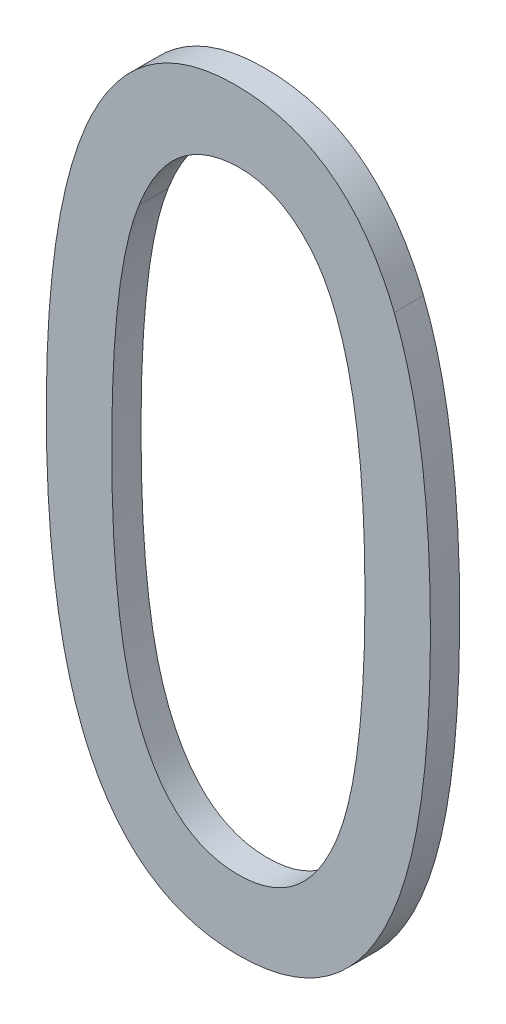
ISO-10303-21;
HEADER;
FILE_DESCRIPTION(('STEP AP214'),'2;1');
FILE_NAME('part.step','',(''),(''),'','','');
FILE_SCHEMA(('AUTOMOTIVE_DESIGN { 1 0 10303 214 1 1 1 1 }'));
ENDSEC;
DATA;
#1=APPLICATION_CONTEXT('core data for automotive mechanical design processes');
#2=APPLICATION_PROTOCOL_DEFINITION('international standard','automotive_design',2000,#1);
#3=PRODUCT_CONTEXT('',#1,'mechanical');
#4=PRODUCT('Part','Part','',(#3));
#5=PRODUCT_RELATED_PRODUCT_CATEGORY('part','',(#4));
#6=PRODUCT_DEFINITION_FORMATION('','',#4);
#7=PRODUCT_DEFINITION_CONTEXT('part definition',#1,'design');
#8=PRODUCT_DEFINITION('design','',#6,#7);
#9=PRODUCT_DEFINITION_SHAPE('','',#8);
#10=(LENGTH_UNIT() NAMED_UNIT(*) SI_UNIT(.MILLI.,.METRE.));
#11=(NAMED_UNIT(*) PLANE_ANGLE_UNIT() SI_UNIT($,.RADIAN.));
#12=(NAMED_UNIT(*) SI_UNIT($,.STERADIAN.) SOLID_ANGLE_UNIT());
#13=UNCERTAINTY_MEASURE_WITH_UNIT(LENGTH_MEASURE(1.E-05),#10,'distance_accuracy_value','');
#14=(GEOMETRIC_REPRESENTATION_CONTEXT(3) GLOBAL_UNCERTAINTY_ASSIGNED_CONTEXT((#13)) GLOBAL_UNIT_ASSIGNED_CONTEXT((#10,
#11,#12)) REPRESENTATION_CONTEXT('',''));
#15=CARTESIAN_POINT('',(0.,0.,0.));
#16=DIRECTION('',(0.,0.,1.));
#17=DIRECTION('',(1.,0.,0.));
#18=AXIS2_PLACEMENT_3D('',#15,#16,#17);
#19=CARTESIAN_POINT('',(162.713224235544,127.21231620352,-39.));
#20=DIRECTION('',(0.,0.,-1.));
#21=DIRECTION('',(-1.,0.,0.));
#22=AXIS2_PLACEMENT_3D('',#19,#20,#21);
#23=PLANE('',#22);
#24=CARTESIAN_POINT('',(162.81965721454,126.928948416499,-39.));
#25=CARTESIAN_POINT('',(162.8134844485,126.9132536326,-39.));
#26=CARTESIAN_POINT('',(162.807884951267,126.897351026162,-39.));
#27=CARTESIAN_POINT('',(162.797637601304,126.865261709913,-39.));
#28=CARTESIAN_POINT('',(162.792988567635,126.849075380124,-39.));
#29=CARTESIAN_POINT('',(162.780199813228,126.800398594227,-39.));
#30=CARTESIAN_POINT('',(162.773158052074,126.767623621181,-39.));
#31=CARTESIAN_POINT('',(162.761115496172,126.701804748235,-39.));
#32=CARTESIAN_POINT('',(162.756109814167,126.668761688815,-39.));
#33=CARTESIAN_POINT('',(162.747583944379,126.602483406797,-39.));
#34=CARTESIAN_POINT('',(162.744063992329,126.569248154551,-39.));
#35=CARTESIAN_POINT('',(162.738154306647,126.502527179504,-39.));
#36=CARTESIAN_POINT('',(162.735769840447,126.469041007509,-39.));
#37=CARTESIAN_POINT('',(162.731919552685,126.402020945451,-39.));
#38=CARTESIAN_POINT('',(162.730453639131,126.368487060503,-39.));
#39=CARTESIAN_POINT('',(162.727655261097,126.282333840904,-39.));
#40=CARTESIAN_POINT('',(162.726871964206,126.229697348207,-39.));
#41=CARTESIAN_POINT('',(162.726672446981,126.124407380514,-39.));
#42=CARTESIAN_POINT('',(162.727256647057,126.071753905273,-39.));
#43=CARTESIAN_POINT('',(162.730143616212,125.96667807193,-39.));
#44=CARTESIAN_POINT('',(162.732440205248,125.914255562964,-39.));
#45=CARTESIAN_POINT('',(162.739377497036,125.80958130951,-39.));
#46=CARTESIAN_POINT('',(162.744016825305,125.757329482953,-39.));
#47=CARTESIAN_POINT('',(162.754713800259,125.670096848505,-39.));
#48=CARTESIAN_POINT('',(162.759824790193,125.635005806208,-39.));
#49=CARTESIAN_POINT('',(162.769198628372,125.582601834786,-39.));
#50=CARTESIAN_POINT('',(162.77261623298,125.565138416614,-39.));
#51=CARTESIAN_POINT('',(162.780151679044,125.530363641215,-39.));
#52=CARTESIAN_POINT('',(162.784269391651,125.513052256624,-39.));
#53=CARTESIAN_POINT('',(162.791651093667,125.485179486085,-39.));
#54=CARTESIAN_POINT('',(162.79464683408,125.47454742445,-39.));
#55=CARTESIAN_POINT('',(162.80103873177,125.453407013795,-39.));
#56=CARTESIAN_POINT('',(162.804434823213,125.442898644748,-39.));
#57=CARTESIAN_POINT('',(162.815155948368,125.411529648948,-39.));
#58=CARTESIAN_POINT('',(162.823008671458,125.390844351044,-39.));
#59=CARTESIAN_POINT('',(162.840434063982,125.350333566177,-39.));
#60=CARTESIAN_POINT('',(162.849997025759,125.33050397234,-39.));
#61=CARTESIAN_POINT('',(162.871260901099,125.29203206789,-39.));
#62=CARTESIAN_POINT('',(162.882958563842,125.273388009325,-39.));
#63=CARTESIAN_POINT('',(162.906839859012,125.240815954733,-39.));
#64=CARTESIAN_POINT('',(162.918641490116,125.226612110535,-39.));
#65=CARTESIAN_POINT('',(162.944228175459,125.200122518193,-39.));
#66=CARTESIAN_POINT('',(162.958010068016,125.187833776389,-39.));
#67=CARTESIAN_POINT('',(162.9876868168,125.165732391389,-39.));
#68=CARTESIAN_POINT('',(163.00360208045,125.155946714029,-39.));
#69=CARTESIAN_POINT('',(163.037017065211,125.139609832536,-39.));
#70=CARTESIAN_POINT('',(163.054516280028,125.133057599154,-39.));
#71=CARTESIAN_POINT('',(163.088512442128,125.123852414056,-39.));
#72=CARTESIAN_POINT('',(163.104920453074,125.120861105097,-39.));
#73=CARTESIAN_POINT('',(163.138019863858,125.117318580688,-39.));
#74=CARTESIAN_POINT('',(163.154711878667,125.116773594918,-39.));
#75=CARTESIAN_POINT('',(163.190247567182,125.118003531979,-39.));
#76=CARTESIAN_POINT('',(163.209082585592,125.120096169283,-39.));
#77=CARTESIAN_POINT('',(163.246017764625,125.127690302763,-39.));
#78=CARTESIAN_POINT('',(163.264120230255,125.133180047794,-39.));
#79=CARTESIAN_POINT('',(163.297961020812,125.147167435493,-39.));
#80=CARTESIAN_POINT('',(163.313774539637,125.155483745994,-39.));
#81=CARTESIAN_POINT('',(163.343702967706,125.174769768659,-39.));
#82=CARTESIAN_POINT('',(163.357815251652,125.185743505126,-39.));
#83=CARTESIAN_POINT('',(163.388090196325,125.213297000385,-39.));
#84=CARTESIAN_POINT('',(163.403611778472,125.230573008783,-39.));
#85=CARTESIAN_POINT('',(163.431801384555,125.267355855728,-39.));
#86=CARTESIAN_POINT('',(163.444457387533,125.286871592626,-39.));
#87=CARTESIAN_POINT('',(163.464327878853,125.321875723023,-39.));
#88=CARTESIAN_POINT('',(163.472095444489,125.337060091012,-39.));
#89=CARTESIAN_POINT('',(163.486450264703,125.367792273056,-39.));
#90=CARTESIAN_POINT('',(163.493048707158,125.383334828578,-39.));
#91=CARTESIAN_POINT('',(163.499197792604,125.399038411206,-39.));
#92=B_SPLINE_CURVE_WITH_KNOTS('',3,(#24,#25,#26,#27,#28,#29,#30,#31,#32,#33,#34,#35,#36,#37,#38,
#39,#40,#41,#42,#43,#44,#45,#46,#47,#48,#49,#50,#51,#52,#53,#54,#55,#56,#57,#58,#59,#60,#61,#62,
#63,#64,#65,#66,#67,#68,#69,#70,#71,#72,#73,#74,#75,#76,#77,#78,#79,#80,#81,#82,#83,#84,#85,#86,
#87,#88,#89,#90,#91),.UNSPECIFIED.,.F.,.F.,(4,2,2,2,2,2,2,2,2,2,2,2,2,2,2,2,2,2,2,2,2,2,2,2,2,2,
2,2,2,2,2,2,2,4),(0.,0.0505598864734928,0.101056565921449,0.201520398804551,0.30174164193107,
0.401978780703057,0.502676488224877,0.603364109413484,0.761266343733168,0.919217128384105,
1.07660060838369,1.23389185876919,1.34021706621775,1.39359050964282,1.44695414085766,
1.48008500979698,1.51321043823765,1.57952088188141,1.64546623600253,1.71131199109488,
1.76654814266498,1.82169706452467,1.87741721830735,1.93311962417807,1.98294739535678,
2.03290198362764,2.08949093296318,2.14588521783798,2.19918888570076,2.25257378499866,
2.32185784254094,2.39142736965928,2.44255239605389,2.49315810580367),.UNSPECIFIED.);
#93=CARTESIAN_POINT('',(162.81965721454,126.928948416499,-39.));
#94=VERTEX_POINT('',#93);
#95=CARTESIAN_POINT('',(163.499197792604,125.399038411206,-39.));
#96=VERTEX_POINT('',#95);
#97=EDGE_CURVE('E82',#94,#96,#92,.T.);
#98=ORIENTED_EDGE('',*,*,#97,.F.);
#99=CARTESIAN_POINT('',(163.499197792604,125.399038411206,-39.));
#100=CARTESIAN_POINT('',(163.505322427112,125.414739762002,-39.));
#101=CARTESIAN_POINT('',(163.510885514498,125.430643427273,-39.));
#102=CARTESIAN_POINT('',(163.5210769636,125.462728729021,-39.));
#103=CARTESIAN_POINT('',(163.525706435265,125.478910010305,-39.));
#104=CARTESIAN_POINT('',(163.538457321666,125.527590671538,-39.));
#105=CARTESIAN_POINT('',(163.545493006535,125.560370708689,-39.));
#106=CARTESIAN_POINT('',(163.557539658802,125.626206099966,-39.));
#107=CARTESIAN_POINT('',(163.562554976667,125.659260704397,-39.));
#108=CARTESIAN_POINT('',(163.571100953329,125.725561759351,-39.));
#109=CARTESIAN_POINT('',(163.574631369045,125.758808240382,-39.));
#110=CARTESIAN_POINT('',(163.583551309013,125.858936864082,-39.));
#111=CARTESIAN_POINT('',(163.587231808044,125.925969366923,-39.));
#112=CARTESIAN_POINT('',(163.590521172219,126.026437311402,-39.));
#113=CARTESIAN_POINT('',(163.59124644928,126.059850293964,-39.));
#114=CARTESIAN_POINT('',(163.592086362,126.126685847795,-39.));
#115=CARTESIAN_POINT('',(163.592200972737,126.1601084194,-39.));
#116=CARTESIAN_POINT('',(163.591622930262,126.260161050749,-39.));
#117=CARTESIAN_POINT('',(163.59001511949,126.326792772413,-39.));
#118=CARTESIAN_POINT('',(163.583918866786,126.447777795609,-39.));
#119=CARTESIAN_POINT('',(163.580007776156,126.502159284629,-39.));
#120=CARTESIAN_POINT('',(163.568938196671,126.610987434158,-39.));
#121=CARTESIAN_POINT('',(163.561758791348,126.665432225956,-39.));
#122=CARTESIAN_POINT('',(163.547227840337,126.746880825657,-39.));
#123=CARTESIAN_POINT('',(163.541698867997,126.774206456517,-39.));
#124=CARTESIAN_POINT('',(163.529003164453,126.828468998898,-39.));
#125=CARTESIAN_POINT('',(163.521837467319,126.855406144487,-39.));
#126=CARTESIAN_POINT('',(163.505434884125,126.908348600257,-39.));
#127=CARTESIAN_POINT('',(163.496220113197,126.93436065426,-39.));
#128=CARTESIAN_POINT('',(163.47493047355,126.985178523736,-39.));
#129=CARTESIAN_POINT('',(163.462863954348,127.009987610473,-39.));
#130=CARTESIAN_POINT('',(163.443868547071,127.041954304919,-39.));
#131=CARTESIAN_POINT('',(163.438669579844,127.050143229378,-39.));
#132=CARTESIAN_POINT('',(163.427724917998,127.066148485094,-39.));
#133=CARTESIAN_POINT('',(163.421979420998,127.073964949506,-39.));
#134=CARTESIAN_POINT('',(163.409850947436,127.089113301841,-39.));
#135=CARTESIAN_POINT('',(163.403466589391,127.096444080067,-39.));
#136=CARTESIAN_POINT('',(163.390241502005,127.110686147085,-39.));
#137=CARTESIAN_POINT('',(163.383400512422,127.117597192304,-39.));
#138=CARTESIAN_POINT('',(163.369181736336,127.130944059741,-39.));
#139=CARTESIAN_POINT('',(163.36180080604,127.137376571876,-39.));
#140=CARTESIAN_POINT('',(163.346546819658,127.149617759199,-39.));
#141=CARTESIAN_POINT('',(163.338673984628,127.155426711465,-39.));
#142=CARTESIAN_POINT('',(163.314364521425,127.171731729472,-39.));
#143=CARTESIAN_POINT('',(163.297180650172,127.181160385396,-39.));
#144=CARTESIAN_POINT('',(163.261916496351,127.196074883058,-39.));
#145=CARTESIAN_POINT('',(163.24389364307,127.201694800711,-39.));
#146=CARTESIAN_POINT('',(163.216299540372,127.207389916442,-39.));
#147=CARTESIAN_POINT('',(163.206990950461,127.208832612515,-39.));
#148=CARTESIAN_POINT('',(163.188273706997,127.210811705159,-39.));
#149=CARTESIAN_POINT('',(163.178865026605,127.21134785214,-39.));
#150=CARTESIAN_POINT('',(163.161323642574,127.21159469605,-39.));
#151=CARTESIAN_POINT('',(163.153191650627,127.211407854803,-39.));
#152=CARTESIAN_POINT('',(163.136957862843,127.210525157236,-39.));
#153=CARTESIAN_POINT('',(163.128856062477,127.209829380619,-39.));
#154=CARTESIAN_POINT('',(163.104669426145,127.206877594109,-39.));
#155=CARTESIAN_POINT('',(163.088678298672,127.203757649748,-39.));
#156=CARTESIAN_POINT('',(163.054309356366,127.19418365331,-39.));
#157=CARTESIAN_POINT('',(163.036075879066,127.187197164989,-39.));
#158=CARTESIAN_POINT('',(163.001338396239,127.169825519232,-39.));
#159=CARTESIAN_POINT('',(162.98483274229,127.159443640891,-39.));
#160=CARTESIAN_POINT('',(162.95271903835,127.134952458311,-39.));
#161=CARTESIAN_POINT('',(162.937291602276,127.120609569158,-39.));
#162=CARTESIAN_POINT('',(162.908898430826,127.089554214469,-39.));
#163=CARTESIAN_POINT('',(162.895948440214,127.07282770049,-39.));
#164=CARTESIAN_POINT('',(162.870751441382,127.035557881647,-39.));
#165=CARTESIAN_POINT('',(162.858826371374,127.01480272305,-39.));
#166=CARTESIAN_POINT('',(162.837542377177,126.97241978189,-39.));
#167=CARTESIAN_POINT('',(162.828145183741,126.950811460588,-39.));
#168=CARTESIAN_POINT('',(162.81965721454,126.928948416499,-39.));
#169=B_SPLINE_CURVE_WITH_KNOTS('',3,(#99,#100,#101,#102,#103,#104,#105,#106,#107,#108,#109,#110,
#111,#112,#113,#114,#115,#116,#117,#118,#119,#120,#121,#122,#123,#124,#125,#126,#127,#128,#129,
#130,#131,#132,#133,#134,#135,#136,#137,#138,#139,#140,#141,#142,#143,#144,#145,#146,#147,#148,
#149,#150,#151,#152,#153,#154,#155,#156,#157,#158,#159,#160,#161,#162,#163,#164,#165,#166,#167,
#168),.UNSPECIFIED.,.F.,.F.,(4,2,2,2,2,2,2,2,2,2,2,2,2,2,2,2,2,2,2,2,2,2,2,2,2,2,2,2,2,2,2,2,2,
2,4),(0.,0.0505272345243584,0.100994039860473,0.201471045431679,0.301730521681772,
0.402006404171568,0.60328173282029,0.703542383201974,0.803807125552918,1.0036863608285,
1.16719799616357,1.33177110790104,1.41537414136467,1.49892450044971,1.58161347457552,
1.66406328249418,1.69314592018893,1.72221808157996,1.75135452644088,1.78050772084123,
1.80984674962599,1.83917268730333,1.89759272369427,1.95383140320012,1.98205245785215,
2.01028128100678,2.03466611588514,2.05904713274505,2.10773462855995,2.16593738065235,
2.22408408863903,2.28693439901847,2.35017175556561,2.42181005807198,2.49229349340743),.UNSPECIFIED.);
#170=EDGE_CURVE('E80',#96,#94,#169,.T.);
#171=ORIENTED_EDGE('',*,*,#170,.F.);
#172=EDGE_LOOP('',(#98,#171));
#173=FACE_BOUND('',#172,.T.);
#174=CARTESIAN_POINT('',(163.692054033926,127.047397331269,-39.));
#175=CARTESIAN_POINT('',(163.704516349728,127.016239052959,-39.));
#176=CARTESIAN_POINT('',(163.71551386743,126.984553230297,-39.));
#177=CARTESIAN_POINT('',(163.735066490346,126.920532400283,-39.));
#178=CARTESIAN_POINT('',(163.743628773889,126.888199608038,-39.));
#179=CARTESIAN_POINT('',(163.766500566805,126.790485439633,-39.));
#180=CARTESIAN_POINT('',(163.777971610316,126.724453357786,-39.));
#181=CARTESIAN_POINT('',(163.795807013261,126.591590758617,-39.));
#182=CARTESIAN_POINT('',(163.802157161003,126.524758538116,-39.));
#183=CARTESIAN_POINT('',(163.811109644074,126.391124081756,-39.));
#184=CARTESIAN_POINT('',(163.813726887734,126.324322797828,-39.));
#185=CARTESIAN_POINT('',(163.815539011626,126.224164073656,-39.));
#186=CARTESIAN_POINT('',(163.815791568004,126.190818575861,-39.));
#187=CARTESIAN_POINT('',(163.815682273306,126.124128247136,-39.));
#188=CARTESIAN_POINT('',(163.815320423262,126.090783416205,-39.));
#189=CARTESIAN_POINT('',(163.813197933937,125.990835520696,-39.));
#190=CARTESIAN_POINT('',(163.810401755168,125.924249957834,-39.));
#191=CARTESIAN_POINT('',(163.801092778465,125.790979948071,-39.));
#192=CARTESIAN_POINT('',(163.794561894739,125.724296606594,-39.));
#193=CARTESIAN_POINT('',(163.779337057708,125.614477984008,-39.));
#194=CARTESIAN_POINT('',(163.772160938042,125.571136226896,-39.));
#195=CARTESIAN_POINT('',(163.75480490558,125.484991781117,-39.));
#196=CARTESIAN_POINT('',(163.744622479836,125.442189574791,-39.));
#197=CARTESIAN_POINT('',(163.720260212584,125.358090061591,-39.));
#198=CARTESIAN_POINT('',(163.706113652657,125.316783327719,-39.));
#199=CARTESIAN_POINT('',(163.673037379582,125.236169628208,-39.));
#200=CARTESIAN_POINT('',(163.65412000488,125.196857813552,-39.));
#201=CARTESIAN_POINT('',(163.616486643065,125.132691357331,-39.));
#202=CARTESIAN_POINT('',(163.599303946285,125.10695083373,-39.));
#203=CARTESIAN_POINT('',(163.561386562326,125.058191271206,-39.));
#204=CARTESIAN_POINT('',(163.540653509967,125.035170987913,-39.));
#205=CARTESIAN_POINT('',(163.495227903633,124.992782631732,-39.));
#206=CARTESIAN_POINT('',(163.470492586655,124.973459568495,-39.));
#207=CARTESIAN_POINT('',(163.417757330673,124.94000460659,-39.));
#208=CARTESIAN_POINT('',(163.38976264747,124.925864498956,-39.));
#209=CARTESIAN_POINT('',(163.334938842379,124.904553866301,-39.));
#210=CARTESIAN_POINT('',(163.308342982861,124.896770916636,-39.));
#211=CARTESIAN_POINT('',(163.254209244307,124.885416501214,-39.));
#212=CARTESIAN_POINT('',(163.226668944096,124.881856845887,-39.));
#213=CARTESIAN_POINT('',(163.184039623071,124.879213715785,-39.));
#214=CARTESIAN_POINT('',(163.169011980785,124.878828071462,-39.));
#215=CARTESIAN_POINT('',(163.138964089566,124.879051701823,-39.));
#216=CARTESIAN_POINT('',(163.12394384101,124.879661022907,-39.));
#217=CARTESIAN_POINT('',(163.079049231334,124.88315286892,-39.));
#218=CARTESIAN_POINT('',(163.049272992495,124.887694520213,-39.));
#219=CARTESIAN_POINT('',(162.993343770729,124.901266698453,-39.));
#220=CARTESIAN_POINT('',(162.967094613356,124.909895658549,-39.));
#221=CARTESIAN_POINT('',(162.916504450116,124.931519950501,-39.));
#222=CARTESIAN_POINT('',(162.892159853067,124.944506807961,-39.));
#223=CARTESIAN_POINT('',(162.846129249909,124.974383658127,-39.));
#224=CARTESIAN_POINT('',(162.824434820934,124.991260765327,-39.));
#225=CARTESIAN_POINT('',(162.783845320252,125.028261644663,-39.));
#226=CARTESIAN_POINT('',(162.764965618006,125.04840207252,-39.));
#227=CARTESIAN_POINT('',(162.721548753456,125.101439244545,-39.));
#228=CARTESIAN_POINT('',(162.698774037328,125.135750005299,-39.));
#229=CARTESIAN_POINT('',(162.658924288357,125.206979693701,-39.));
#230=CARTESIAN_POINT('',(162.641776933344,125.243857486225,-39.));
#231=CARTESIAN_POINT('',(162.626800973217,125.281251222217,-39.));
#232=B_SPLINE_CURVE_WITH_KNOTS('',3,(#174,#175,#176,#177,#178,#179,#180,#181,#182,#183,#184,
#185,#186,#187,#188,#189,#190,#191,#192,#193,#194,#195,#196,#197,#198,#199,#200,#201,#202,#203,
#204,#205,#206,#207,#208,#209,#210,#211,#212,#213,#214,#215,#216,#217,#218,#219,#220,#221,#222,
#223,#224,#225,#226,#227,#228,#229,#230,#231),.UNSPECIFIED.,.F.,.F.,(4,2,2,2,2,2,2,2,2,2,2,2,2,
2,2,2,2,2,2,2,2,2,2,2,2,2,2,2,4),(0.,0.100558694918868,0.200817826406479,0.401542047706388,
0.602821427213916,0.803294672023267,0.903330108470041,1.00336537691816,1.20322873447941,
1.40406825296392,1.53579185395414,1.66762587495601,1.79838461587437,1.92880859115141,
2.02140063548079,2.11395015836423,2.20756322165538,2.30102736961859,2.3837951870279,
2.46679392288349,2.5118632213648,2.55693462169352,2.64687466350649,2.72938910637855,
2.81174401210934,2.89382996037286,2.97634889005706,3.09931227669091,3.22062708793923),.UNSPECIFIED.);
#233=CARTESIAN_POINT('',(163.692054033926,127.047397331269,-39.));
#234=VERTEX_POINT('',#233);
#235=CARTESIAN_POINT('',(162.626800973217,125.281251222217,-39.));
#236=VERTEX_POINT('',#235);
#237=EDGE_CURVE('E67',#234,#236,#232,.T.);
#238=ORIENTED_EDGE('',*,*,#237,.F.);
#239=CARTESIAN_POINT('',(162.626800973217,125.281251222217,-39.));
#240=CARTESIAN_POINT('',(162.614372421751,125.312438437969,-39.));
#241=CARTESIAN_POINT('',(162.603397346855,125.344151570257,-39.));
#242=CARTESIAN_POINT('',(162.583891946106,125.408186833191,-39.));
#243=CARTESIAN_POINT('',(162.575351823913,125.440505949572,-39.));
#244=CARTESIAN_POINT('',(162.560152557446,125.505605658729,-39.));
#245=CARTESIAN_POINT('',(162.553495482818,125.538386718016,-39.));
#246=CARTESIAN_POINT('',(162.541735335393,125.604230220191,-39.));
#247=CARTESIAN_POINT('',(162.536632584214,125.637292719861,-39.));
#248=CARTESIAN_POINT('',(162.527700646534,125.703715925087,-39.));
#249=CARTESIAN_POINT('',(162.523876456175,125.737077289236,-39.));
#250=CARTESIAN_POINT('',(162.517327287594,125.803902241854,-39.));
#251=CARTESIAN_POINT('',(162.514602212573,125.837365821059,-39.));
#252=CARTESIAN_POINT('',(162.507906952346,125.936709324496,-39.));
#253=CARTESIAN_POINT('',(162.505276379631,126.002680957742,-39.));
#254=CARTESIAN_POINT('',(162.503378707812,126.101675553336,-39.));
#255=CARTESIAN_POINT('',(162.503087687739,126.134687712191,-39.));
#256=CARTESIAN_POINT('',(162.503135038236,126.200719925422,-39.));
#257=CARTESIAN_POINT('',(162.503473553174,126.233739979873,-39.));
#258=CARTESIAN_POINT('',(162.505568025031,126.332578651519,-39.));
#259=CARTESIAN_POINT('',(162.508398322543,126.398379850558,-39.));
#260=CARTESIAN_POINT('',(162.51776415504,126.529710864489,-39.));
#261=CARTESIAN_POINT('',(162.524297933443,126.595240793214,-39.));
#262=CARTESIAN_POINT('',(162.540539432054,126.712240766798,-39.));
#263=CARTESIAN_POINT('',(162.549320241303,126.763835532175,-39.));
#264=CARTESIAN_POINT('',(162.571110274626,126.866292871823,-39.));
#265=CARTESIAN_POINT('',(162.584129298853,126.917153461004,-39.));
#266=CARTESIAN_POINT('',(162.61609221524,127.017784134273,-39.));
#267=CARTESIAN_POINT('',(162.635112416527,127.067530800492,-39.));
#268=CARTESIAN_POINT('',(162.681310712821,127.163108181109,-39.));
#269=CARTESIAN_POINT('',(162.708446670672,127.208957588125,-39.));
#270=CARTESIAN_POINT('',(162.758172998801,127.273097291111,-39.));
#271=CARTESIAN_POINT('',(162.776997579081,127.29428001906,-39.));
#272=CARTESIAN_POINT('',(162.817784095223,127.333358878961,-39.));
#273=CARTESIAN_POINT('',(162.839740387353,127.351260793533,-39.));
#274=CARTESIAN_POINT('',(162.886666753729,127.382968304412,-39.));
#275=CARTESIAN_POINT('',(162.911655613508,127.396746322067,-39.));
#276=CARTESIAN_POINT('',(162.963768172004,127.419488708747,-39.));
#277=CARTESIAN_POINT('',(162.990894141087,127.42844787719,-39.));
#278=CARTESIAN_POINT('',(163.034453299276,127.438826092904,-39.));
#279=CARTESIAN_POINT('',(163.050534429617,127.441831460384,-39.));
#280=CARTESIAN_POINT('',(163.082909432708,127.446389016085,-39.));
#281=CARTESIAN_POINT('',(163.099203384562,127.447940647427,-39.));
#282=CARTESIAN_POINT('',(163.131903672785,127.449709274447,-39.));
#283=CARTESIAN_POINT('',(163.148310197375,127.449922434881,-39.));
#284=CARTESIAN_POINT('',(163.181096956771,127.449196107889,-39.));
#285=CARTESIAN_POINT('',(163.197477191341,127.448256610121,-39.));
#286=CARTESIAN_POINT('',(163.230491328927,127.445045138324,-39.));
#287=CARTESIAN_POINT('',(163.247122475831,127.442743207883,-39.));
#288=CARTESIAN_POINT('',(163.280108265208,127.436680429768,-39.));
#289=CARTESIAN_POINT('',(163.29646297323,127.43291993317,-39.));
#290=CARTESIAN_POINT('',(163.344725375998,127.419338018988,-39.));
#291=CARTESIAN_POINT('',(163.376031208704,127.407199497073,-39.));
#292=CARTESIAN_POINT('',(163.432538777686,127.37827772482,-39.));
#293=CARTESIAN_POINT('',(163.458038031974,127.362069578845,-39.));
#294=CARTESIAN_POINT('',(163.505801920238,127.325361282833,-39.));
#295=CARTESIAN_POINT('',(163.528058236648,127.304850414373,-39.));
#296=CARTESIAN_POINT('',(163.574736758744,127.254507298031,-39.));
#297=CARTESIAN_POINT('',(163.598057156322,127.223665617727,-39.));
#298=CARTESIAN_POINT('',(163.639559918572,127.158771336518,-39.));
#299=CARTESIAN_POINT('',(163.657737466629,127.124715765134,-39.));
#300=CARTESIAN_POINT('',(163.680211621763,127.075747667786,-39.));
#301=CARTESIAN_POINT('',(163.686286485387,127.061626812379,-39.));
#302=CARTESIAN_POINT('',(163.692054033926,127.047397331269,-39.));
#303=B_SPLINE_CURVE_WITH_KNOTS('',3,(#239,#240,#241,#242,#243,#244,#245,#246,#247,#248,#249,
#250,#251,#252,#253,#254,#255,#256,#257,#258,#259,#260,#261,#262,#263,#264,#265,#266,#267,#268,
#269,#270,#271,#272,#273,#274,#275,#276,#277,#278,#279,#280,#281,#282,#283,#284,#285,#286,#287,
#288,#289,#290,#291,#292,#293,#294,#295,#296,#297,#298,#299,#300,#301,#302),.UNSPECIFIED.,.F.,
.F.,(4,2,2,2,2,2,2,2,2,2,2,2,2,2,2,2,2,2,2,2,2,2,2,2,2,2,2,2,2,2,2,4),(0.,0.100610747931688,
0.200810813564842,0.30112058438777,0.401451097140875,0.50216920297916,0.602878436567561,
0.800859480675481,0.899896603984995,0.998956441695701,1.19646422326872,1.39387840405627,
1.55076633803255,1.70801965667093,1.86735912610077,2.02588525484784,2.11060474335928,
2.19517344188428,2.28029566957847,2.3655095791808,2.41452921553174,2.46356762208212,
2.51274647897314,2.56192577708358,2.61222881688859,2.66251975628213,2.76250912971167,
2.85265199939589,2.94302214686374,3.05837189556448,3.17382932187213,3.2199194418832),.UNSPECIFIED.);
#304=EDGE_CURVE('E24',#236,#234,#303,.T.);
#305=ORIENTED_EDGE('',*,*,#304,.F.);
#306=EDGE_LOOP('',(#238,#305));
#307=FACE_BOUND('',#306,.T.);
#308=ADVANCED_FACE('F17',(#173,#307),#23,.F.);
#309=CARTESIAN_POINT('',(163.692054033926,127.047397331269,-39.1));
#310=CARTESIAN_POINT('',(163.692054033926,127.047397331269,-39.));
#311=CARTESIAN_POINT('',(163.583509290773,127.315396272508,-39.1));
#312=CARTESIAN_POINT('',(163.583509290773,127.315396272508,-39.));
#313=CARTESIAN_POINT('',(163.402264812672,127.449726606018,-39.1));
#314=CARTESIAN_POINT('',(163.402264812672,127.449726606018,-39.));
#315=CARTESIAN_POINT('',(162.718685360444,127.449726606018,-39.1));
#316=CARTESIAN_POINT('',(162.718685360444,127.449726606018,-39.));
#317=CARTESIAN_POINT('',(162.50311045195,127.021590025817,-39.1));
#318=CARTESIAN_POINT('',(162.50311045195,127.021590025817,-39.));
#319=CARTESIAN_POINT('',(162.50311045195,125.781515912529,-39.1));
#320=CARTESIAN_POINT('',(162.50311045195,125.781515912529,-39.));
#321=CARTESIAN_POINT('',(162.544508912129,125.487047940057,-39.1));
#322=CARTESIAN_POINT('',(162.544508912129,125.487047940057,-39.));
#323=CARTESIAN_POINT('',(162.626800973217,125.281251222217,-39.1));
#324=CARTESIAN_POINT('',(162.626800973217,125.281251222217,-39.));
#325=B_SPLINE_SURFACE_WITH_KNOTS('',3,1,((#309,#310),(#311,#312),(#313,#314),(#315,#316),(#317,
#318),(#319,#320),(#321,#322),(#323,#324)),.UNSPECIFIED.,.F.,.F.,.F.,(4,2,2,4),(2,2),(0.,
0.288697589169657,0.780232606258928,1.),(1.,1.1),.UNSPECIFIED.);
#326=CARTESIAN_POINT('',(162.626800973217,125.281251222217,-39.1));
#327=CARTESIAN_POINT('',(162.614372421751,125.312438437969,-39.1));
#328=CARTESIAN_POINT('',(162.603397346855,125.344151570257,-39.1));
#329=CARTESIAN_POINT('',(162.583891946106,125.408186833191,-39.1));
#330=CARTESIAN_POINT('',(162.575351823913,125.440505949572,-39.1));
#331=CARTESIAN_POINT('',(162.560152557446,125.505605658729,-39.1));
#332=CARTESIAN_POINT('',(162.553495482818,125.538386718016,-39.1));
#333=CARTESIAN_POINT('',(162.541735335393,125.604230220191,-39.1));
#334=CARTESIAN_POINT('',(162.536632584214,125.637292719861,-39.1));
#335=CARTESIAN_POINT('',(162.527700646534,125.703715925087,-39.1));
#336=CARTESIAN_POINT('',(162.523876456175,125.737077289236,-39.1));
#337=CARTESIAN_POINT('',(162.517327287594,125.803902241854,-39.1));
#338=CARTESIAN_POINT('',(162.514602212573,125.837365821059,-39.1));
#339=CARTESIAN_POINT('',(162.507906952346,125.936709324496,-39.1));
#340=CARTESIAN_POINT('',(162.505276379631,126.002680957742,-39.1));
#341=CARTESIAN_POINT('',(162.503378707812,126.101675553336,-39.1));
#342=CARTESIAN_POINT('',(162.503087687739,126.134687712191,-39.1));
#343=CARTESIAN_POINT('',(162.503135038236,126.200719925422,-39.1));
#344=CARTESIAN_POINT('',(162.503473553174,126.233739979873,-39.1));
#345=CARTESIAN_POINT('',(162.505568025031,126.332578651519,-39.1));
#346=CARTESIAN_POINT('',(162.508398322543,126.398379850558,-39.1));
#347=CARTESIAN_POINT('',(162.51776415504,126.529710864489,-39.1));
#348=CARTESIAN_POINT('',(162.524297933443,126.595240793214,-39.1));
#349=CARTESIAN_POINT('',(162.540539432054,126.712240766798,-39.1));
#350=CARTESIAN_POINT('',(162.549320241303,126.763835532175,-39.1));
#351=CARTESIAN_POINT('',(162.571110274626,126.866292871823,-39.1));
#352=CARTESIAN_POINT('',(162.584129298853,126.917153461004,-39.1));
#353=CARTESIAN_POINT('',(162.61609221524,127.017784134273,-39.1));
#354=CARTESIAN_POINT('',(162.635112416527,127.067530800492,-39.1));
#355=CARTESIAN_POINT('',(162.681310712821,127.163108181109,-39.1));
#356=CARTESIAN_POINT('',(162.708446670672,127.208957588125,-39.1));
#357=CARTESIAN_POINT('',(162.758172998801,127.273097291111,-39.1));
#358=CARTESIAN_POINT('',(162.776997579081,127.29428001906,-39.1));
#359=CARTESIAN_POINT('',(162.817784095223,127.333358878961,-39.1));
#360=CARTESIAN_POINT('',(162.839740387353,127.351260793533,-39.1));
#361=CARTESIAN_POINT('',(162.886666753729,127.382968304412,-39.1));
#362=CARTESIAN_POINT('',(162.911655613508,127.396746322067,-39.1));
#363=CARTESIAN_POINT('',(162.963768172005,127.419488708747,-39.1));
#364=CARTESIAN_POINT('',(162.990894141087,127.42844787719,-39.1));
#365=CARTESIAN_POINT('',(163.034453299276,127.438826092904,-39.1));
#366=CARTESIAN_POINT('',(163.050534429617,127.441831460384,-39.1));
#367=CARTESIAN_POINT('',(163.082909432708,127.446389016085,-39.1));
#368=CARTESIAN_POINT('',(163.099203384562,127.447940647427,-39.1));
#369=CARTESIAN_POINT('',(163.131903672786,127.449709274447,-39.1));
#370=CARTESIAN_POINT('',(163.148310197375,127.449922434881,-39.1));
#371=CARTESIAN_POINT('',(163.181096956772,127.449196107889,-39.1));
#372=CARTESIAN_POINT('',(163.197477191341,127.448256610121,-39.1));
#373=CARTESIAN_POINT('',(163.230491328927,127.445045138324,-39.1));
#374=CARTESIAN_POINT('',(163.247122475832,127.442743207883,-39.1));
#375=CARTESIAN_POINT('',(163.280108265208,127.436680429768,-39.1));
#376=CARTESIAN_POINT('',(163.296462973231,127.43291993317,-39.1));
#377=CARTESIAN_POINT('',(163.344725375998,127.419338018988,-39.1));
#378=CARTESIAN_POINT('',(163.376031208704,127.407199497073,-39.1));
#379=CARTESIAN_POINT('',(163.432538777687,127.37827772482,-39.1));
#380=CARTESIAN_POINT('',(163.458038031974,127.362069578845,-39.1));
#381=CARTESIAN_POINT('',(163.505801920238,127.325361282832,-39.1));
#382=CARTESIAN_POINT('',(163.528058236648,127.304850414372,-39.1));
#383=CARTESIAN_POINT('',(163.574736758744,127.254507298031,-39.1));
#384=CARTESIAN_POINT('',(163.598057156323,127.223665617726,-39.1));
#385=CARTESIAN_POINT('',(163.639559918572,127.158771336518,-39.1));
#386=CARTESIAN_POINT('',(163.65773746663,127.124715765133,-39.1000000000001));
#387=CARTESIAN_POINT('',(163.680211621764,127.075747667785,-39.1));
#388=CARTESIAN_POINT('',(163.686286485388,127.061626812378,-39.1));
#389=CARTESIAN_POINT('',(163.692054033926,127.047397331269,-39.1));
#390=B_SPLINE_CURVE_WITH_KNOTS('',3,(#326,#327,#328,#329,#330,#331,#332,#333,#334,#335,#336,
#337,#338,#339,#340,#341,#342,#343,#344,#345,#346,#347,#348,#349,#350,#351,#352,#353,#354,#355,
#356,#357,#358,#359,#360,#361,#362,#363,#364,#365,#366,#367,#368,#369,#370,#371,#372,#373,#374,
#375,#376,#377,#378,#379,#380,#381,#382,#383,#384,#385,#386,#387,#388,#389),.UNSPECIFIED.,.F.,
.F.,(4,2,2,2,2,2,2,2,2,2,2,2,2,2,2,2,2,2,2,2,2,2,2,2,2,2,2,2,2,2,2,4),(0.,0.100610747931688,
0.200810813564842,0.301120584387776,0.401451097140885,0.502169202979166,0.602878436567565,
0.800859480675486,0.899896603984973,0.998956441695679,1.19646422326872,1.3938784040563,
1.55076633803261,1.70801965667099,1.86735912610082,2.02588525484789,2.11060474335935,
2.19517344188437,2.28029566957853,2.3655095791809,2.41452921553189,2.46356762208234,
2.51274647897338,2.56192577708385,2.61222881688888,2.66251975628247,2.76250912971199,
2.85265199939623,2.94302214686409,3.05837189556505,3.1738293218729,3.21991944188317),.UNSPECIFIED.);
#391=CARTESIAN_POINT('',(162.626800973217,125.281251222217,-39.1));
#392=VERTEX_POINT('',#391);
#393=CARTESIAN_POINT('',(163.692054033926,127.047397331269,-39.1));
#394=VERTEX_POINT('',#393);
#395=EDGE_CURVE('E111',#392,#394,#390,.T.);
#396=DIRECTION('',(0.,0.,-1.));
#397=VECTOR('',#396,1.);
#398=CARTESIAN_POINT('',(162.626800973217,125.281251222217,-39.05));
#399=LINE('',#398,#397);
#400=EDGE_CURVE('E71',#236,#392,#399,.T.);
#401=DIRECTION('',(0.,0.,1.));
#402=VECTOR('',#401,1.);
#403=CARTESIAN_POINT('',(163.692054033926,127.047397331269,-39.05));
#404=LINE('',#403,#402);
#405=EDGE_CURVE('E74',#394,#234,#404,.T.);
#406=ORIENTED_EDGE('',*,*,#395,.F.);
#407=ORIENTED_EDGE('',*,*,#400,.F.);
#408=ORIENTED_EDGE('',*,*,#304,.T.);
#409=ORIENTED_EDGE('',*,*,#405,.F.);
#410=EDGE_LOOP('',(#406,#407,#408,#409));
#411=FACE_BOUND('',#410,.T.);
#412=ADVANCED_FACE('F73',(#411),#325,.T.);
#413=CARTESIAN_POINT('',(162.626800973217,125.281251222217,-39.1));
#414=CARTESIAN_POINT('',(162.626800973217,125.281251222217,-39.));
#415=CARTESIAN_POINT('',(162.73445526624,125.012028409316,-39.1));
#416=CARTESIAN_POINT('',(162.73445526624,125.012028409316,-39.));
#417=CARTESIAN_POINT('',(162.913056179578,124.878921947468,-39.1));
#418=CARTESIAN_POINT('',(162.913056179578,124.878921947468,-39.));
#419=CARTESIAN_POINT('',(163.425993198384,124.878921947468,-39.1));
#420=CARTESIAN_POINT('',(163.425993198384,124.878921947468,-39.));
#421=CARTESIAN_POINT('',(163.612286269191,125.036412683307,-39.1));
#422=CARTESIAN_POINT('',(163.612286269191,125.036412683307,-39.));
#423=CARTESIAN_POINT('',(163.783226592328,125.549151100071,-39.1));
#424=CARTESIAN_POINT('',(163.783226592328,125.549151100071,-39.));
#425=CARTESIAN_POINT('',(163.815744555194,125.820557733598,-39.1));
#426=CARTESIAN_POINT('',(163.815744555194,125.820557733598,-39.));
#427=CARTESIAN_POINT('',(163.815744555194,126.549117818299,-39.1));
#428=CARTESIAN_POINT('',(163.815744555194,126.549117818299,-39.));
#429=CARTESIAN_POINT('',(163.774346095014,126.84226233921,-39.1));
#430=CARTESIAN_POINT('',(163.774346095014,126.84226233921,-39.));
#431=CARTESIAN_POINT('',(163.692054033926,127.047397331269,-39.1));
#432=CARTESIAN_POINT('',(163.692054033926,127.047397331269,-39.));
#433=B_SPLINE_SURFACE_WITH_KNOTS('',3,1,((#413,#414),(#415,#416),(#417,#418),(#419,#420),(#421,
#422),(#423,#424),(#425,#426),(#427,#428),(#429,#430),(#431,#432)),.UNSPECIFIED.,.F.,.F.,.F.,(4,
2,2,2,4),(2,2),(0.,0.28393546910029,0.592358186049064,0.785997303847739,1.),(1.,1.1),.UNSPECIFIED.);
#434=CARTESIAN_POINT('',(163.692054033926,127.047397331269,-39.1));
#435=CARTESIAN_POINT('',(163.704516349728,127.016239052959,-39.1));
#436=CARTESIAN_POINT('',(163.71551386743,126.984553230297,-39.1));
#437=CARTESIAN_POINT('',(163.735066490346,126.920532400283,-39.1));
#438=CARTESIAN_POINT('',(163.743628773889,126.888199608038,-39.1));
#439=CARTESIAN_POINT('',(163.766500566805,126.790485439633,-39.1));
#440=CARTESIAN_POINT('',(163.777971610316,126.724453357786,-39.1));
#441=CARTESIAN_POINT('',(163.795807013261,126.591590758617,-39.1));
#442=CARTESIAN_POINT('',(163.802157161003,126.524758538116,-39.1));
#443=CARTESIAN_POINT('',(163.811109644074,126.391124081756,-39.1));
#444=CARTESIAN_POINT('',(163.813726887734,126.324322797828,-39.1));
#445=CARTESIAN_POINT('',(163.815539011626,126.224164073656,-39.1));
#446=CARTESIAN_POINT('',(163.815791568004,126.190818575861,-39.1));
#447=CARTESIAN_POINT('',(163.815682273306,126.124128247136,-39.1));
#448=CARTESIAN_POINT('',(163.815320423262,126.090783416205,-39.1));
#449=CARTESIAN_POINT('',(163.813197933937,125.990835520696,-39.1000000000001));
#450=CARTESIAN_POINT('',(163.810401755168,125.924249957834,-39.1));
#451=CARTESIAN_POINT('',(163.801092778465,125.790979948071,-39.1));
#452=CARTESIAN_POINT('',(163.794561894739,125.724296606594,-39.1));
#453=CARTESIAN_POINT('',(163.779337057708,125.614477984008,-39.1));
#454=CARTESIAN_POINT('',(163.772160938042,125.571136226896,-39.1));
#455=CARTESIAN_POINT('',(163.75480490558,125.484991781117,-39.1));
#456=CARTESIAN_POINT('',(163.744622479836,125.442189574791,-39.1));
#457=CARTESIAN_POINT('',(163.720260212584,125.358090061591,-39.1));
#458=CARTESIAN_POINT('',(163.706113652657,125.316783327719,-39.1));
#459=CARTESIAN_POINT('',(163.673037379582,125.236169628208,-39.1));
#460=CARTESIAN_POINT('',(163.65412000488,125.196857813552,-39.1));
#461=CARTESIAN_POINT('',(163.616486643065,125.132691357331,-39.1));
#462=CARTESIAN_POINT('',(163.599303946285,125.10695083373,-39.1));
#463=CARTESIAN_POINT('',(163.561386562326,125.058191271206,-39.1));
#464=CARTESIAN_POINT('',(163.540653509967,125.035170987913,-39.1));
#465=CARTESIAN_POINT('',(163.495227903633,124.992782631732,-39.1));
#466=CARTESIAN_POINT('',(163.470492586655,124.973459568495,-39.1));
#467=CARTESIAN_POINT('',(163.417757330673,124.94000460659,-39.1));
#468=CARTESIAN_POINT('',(163.38976264747,124.925864498956,-39.1));
#469=CARTESIAN_POINT('',(163.334938842379,124.904553866301,-39.1));
#470=CARTESIAN_POINT('',(163.308342982861,124.896770916636,-39.1));
#471=CARTESIAN_POINT('',(163.254209244307,124.885416501214,-39.1));
#472=CARTESIAN_POINT('',(163.226668944096,124.881856845887,-39.1));
#473=CARTESIAN_POINT('',(163.184039623071,124.879213715785,-39.1));
#474=CARTESIAN_POINT('',(163.169011980785,124.878828071462,-39.1));
#475=CARTESIAN_POINT('',(163.138964089566,124.879051701823,-39.1));
#476=CARTESIAN_POINT('',(163.12394384101,124.879661022907,-39.1));
#477=CARTESIAN_POINT('',(163.079049231334,124.883152868919,-39.1));
#478=CARTESIAN_POINT('',(163.049272992494,124.887694520213,-39.1));
#479=CARTESIAN_POINT('',(162.993343770729,124.901266698453,-39.1));
#480=CARTESIAN_POINT('',(162.967094613356,124.909895658549,-39.1));
#481=CARTESIAN_POINT('',(162.916504450116,124.931519950501,-39.1));
#482=CARTESIAN_POINT('',(162.892159853067,124.944506807961,-39.1));
#483=CARTESIAN_POINT('',(162.846129249909,124.974383658127,-39.1));
#484=CARTESIAN_POINT('',(162.824434820934,124.991260765327,-39.1));
#485=CARTESIAN_POINT('',(162.783845320252,125.028261644664,-39.1));
#486=CARTESIAN_POINT('',(162.764965618006,125.04840207252,-39.1));
#487=CARTESIAN_POINT('',(162.721548753456,125.101439244545,-39.1));
#488=CARTESIAN_POINT('',(162.698774037328,125.135750005299,-39.1));
#489=CARTESIAN_POINT('',(162.658924288357,125.206979693701,-39.1));
#490=CARTESIAN_POINT('',(162.641776933345,125.243857486226,-39.1));
#491=CARTESIAN_POINT('',(162.626800973217,125.281251222217,-39.1));
#492=B_SPLINE_CURVE_WITH_KNOTS('',3,(#434,#435,#436,#437,#438,#439,#440,#441,#442,#443,#444,
#445,#446,#447,#448,#449,#450,#451,#452,#453,#454,#455,#456,#457,#458,#459,#460,#461,#462,#463,
#464,#465,#466,#467,#468,#469,#470,#471,#472,#473,#474,#475,#476,#477,#478,#479,#480,#481,#482,
#483,#484,#485,#486,#487,#488,#489,#490,#491),.UNSPECIFIED.,.F.,.F.,(4,2,2,2,2,2,2,2,2,2,2,2,2,
2,2,2,2,2,2,2,2,2,2,2,2,2,2,2,4),(0.,0.100558694918885,0.200817826406476,0.401542047706381,
0.602821427213911,0.803294672023263,0.903330108470037,1.00336537691816,1.20322873447943,
1.40406825296391,1.53579185395414,1.66762587495599,1.79838461587435,1.92880859115142,
2.02140063548077,2.11395015836423,2.20756322165539,2.30102736961862,2.38379518702793,
2.46679392288346,2.51186322136483,2.55693462169361,2.64687466350657,2.72938910637868,
2.81174401210946,2.89382996037298,2.97634889005722,3.09931227669101,3.22062708793922),.UNSPECIFIED.);
#493=EDGE_CURVE('E78',#394,#392,#492,.T.);
#494=ORIENTED_EDGE('',*,*,#493,.F.);
#495=ORIENTED_EDGE('',*,*,#405,.T.);
#496=ORIENTED_EDGE('',*,*,#237,.T.);
#497=ORIENTED_EDGE('',*,*,#400,.T.);
#498=EDGE_LOOP('',(#494,#495,#496,#497));
#499=FACE_BOUND('',#498,.T.);
#500=ADVANCED_FACE('F76',(#499),#433,.T.);
#501=CARTESIAN_POINT('',(162.81965721454,126.928948416499,-39.1));
#502=CARTESIAN_POINT('',(162.81965721454,126.928948416499,-39.));
#503=CARTESIAN_POINT('',(162.892356949489,127.116878538257,-39.1));
#504=CARTESIAN_POINT('',(162.892356949489,127.116878538257,-39.));
#505=CARTESIAN_POINT('',(163.007464863158,127.211505324917,-39.1));
#506=CARTESIAN_POINT('',(163.007464863158,127.211505324917,-39.));
#507=CARTESIAN_POINT('',(163.256865342774,127.211505324917,-39.1));
#508=CARTESIAN_POINT('',(163.256865342774,127.211505324917,-39.));
#509=CARTESIAN_POINT('',(163.337642826051,127.171801778066,-39.1));
#510=CARTESIAN_POINT('',(163.337642826051,127.171801778066,-39.));
#511=CARTESIAN_POINT('',(163.529763236629,126.951463841098,-39.1));
#512=CARTESIAN_POINT('',(163.529763236629,126.951463841098,-39.));
#513=CARTESIAN_POINT('',(163.592091898372,126.641759427616,-39.1));
#514=CARTESIAN_POINT('',(163.592091898372,126.641759427616,-39.));
#515=CARTESIAN_POINT('',(163.592091898372,125.812617024228,-39.1));
#516=CARTESIAN_POINT('',(163.592091898372,125.812617024228,-39.));
#517=CARTESIAN_POINT('',(163.561295482872,125.557852598606,-39.1));
#518=CARTESIAN_POINT('',(163.561295482872,125.557852598606,-39.));
#519=CARTESIAN_POINT('',(163.499197792604,125.399038411206,-39.1));
#520=CARTESIAN_POINT('',(163.499197792604,125.399038411206,-39.));
#521=B_SPLINE_SURFACE_WITH_KNOTS('',3,1,((#501,#502),(#503,#504),(#505,#506),(#507,#508),(#509,
#510),(#511,#512),(#513,#514),(#515,#516),(#517,#518),(#519,#520)),.UNSPECIFIED.,.F.,.F.,.F.,(4,
2,2,2,4),(2,2),(0.,0.295831154739301,0.466902844860129,0.77450798705177,1.),(1.,1.1),.UNSPECIFIED.);
#522=CARTESIAN_POINT('',(163.499197792604,125.399038411206,-39.1));
#523=CARTESIAN_POINT('',(163.505322427112,125.414739762002,-39.1));
#524=CARTESIAN_POINT('',(163.510885514498,125.430643427273,-39.1));
#525=CARTESIAN_POINT('',(163.5210769636,125.462728729021,-39.1));
#526=CARTESIAN_POINT('',(163.525706435265,125.478910010305,-39.1));
#527=CARTESIAN_POINT('',(163.538457321665,125.527590671538,-39.1));
#528=CARTESIAN_POINT('',(163.545493006535,125.560370708689,-39.1));
#529=CARTESIAN_POINT('',(163.557539658802,125.626206099966,-39.1));
#530=CARTESIAN_POINT('',(163.562554976667,125.659260704397,-39.1));
#531=CARTESIAN_POINT('',(163.571100953329,125.725561759351,-39.1));
#532=CARTESIAN_POINT('',(163.574631369045,125.758808240382,-39.1));
#533=CARTESIAN_POINT('',(163.583551309013,125.858936864082,-39.1));
#534=CARTESIAN_POINT('',(163.587231808044,125.925969366923,-39.1));
#535=CARTESIAN_POINT('',(163.590521172219,126.026437311402,-39.1));
#536=CARTESIAN_POINT('',(163.59124644928,126.059850293964,-39.1));
#537=CARTESIAN_POINT('',(163.592086362,126.126685847795,-39.1));
#538=CARTESIAN_POINT('',(163.592200972737,126.1601084194,-39.1));
#539=CARTESIAN_POINT('',(163.591622930262,126.260161050749,-39.1));
#540=CARTESIAN_POINT('',(163.59001511949,126.326792772413,-39.1));
#541=CARTESIAN_POINT('',(163.583918866786,126.447777795609,-39.1));
#542=CARTESIAN_POINT('',(163.580007776156,126.502159284629,-39.1));
#543=CARTESIAN_POINT('',(163.568938196671,126.610987434158,-39.1));
#544=CARTESIAN_POINT('',(163.561758791348,126.665432225956,-39.1));
#545=CARTESIAN_POINT('',(163.547227840337,126.746880825657,-39.1));
#546=CARTESIAN_POINT('',(163.541698867997,126.774206456517,-39.1));
#547=CARTESIAN_POINT('',(163.529003164453,126.828468998898,-39.1));
#548=CARTESIAN_POINT('',(163.521837467319,126.855406144487,-39.1));
#549=CARTESIAN_POINT('',(163.505434884125,126.908348600257,-39.1));
#550=CARTESIAN_POINT('',(163.496220113197,126.934360654261,-39.1));
#551=CARTESIAN_POINT('',(163.47493047355,126.985178523736,-39.1));
#552=CARTESIAN_POINT('',(163.462863954348,127.009987610473,-39.1));
#553=CARTESIAN_POINT('',(163.443868547071,127.041954304919,-39.1));
#554=CARTESIAN_POINT('',(163.438669579844,127.050143229378,-39.1));
#555=CARTESIAN_POINT('',(163.427724917998,127.066148485094,-39.1));
#556=CARTESIAN_POINT('',(163.421979420998,127.073964949506,-39.1));
#557=CARTESIAN_POINT('',(163.409850947436,127.089113301841,-39.1));
#558=CARTESIAN_POINT('',(163.403466589391,127.096444080067,-39.1));
#559=CARTESIAN_POINT('',(163.390241502005,127.110686147085,-39.1));
#560=CARTESIAN_POINT('',(163.383400512422,127.117597192304,-39.1));
#561=CARTESIAN_POINT('',(163.369181736336,127.130944059741,-39.1));
#562=CARTESIAN_POINT('',(163.36180080604,127.137376571876,-39.1));
#563=CARTESIAN_POINT('',(163.346546819658,127.149617759199,-39.1));
#564=CARTESIAN_POINT('',(163.338673984628,127.155426711465,-39.1));
#565=CARTESIAN_POINT('',(163.314364521425,127.171731729472,-39.1));
#566=CARTESIAN_POINT('',(163.297180650172,127.181160385396,-39.1));
#567=CARTESIAN_POINT('',(163.261916496351,127.196074883058,-39.1));
#568=CARTESIAN_POINT('',(163.24389364307,127.201694800711,-39.1));
#569=CARTESIAN_POINT('',(163.216299540372,127.207389916442,-39.1));
#570=CARTESIAN_POINT('',(163.206990950461,127.208832612515,-39.1));
#571=CARTESIAN_POINT('',(163.188273706997,127.210811705159,-39.1));
#572=CARTESIAN_POINT('',(163.178865026605,127.21134785214,-39.1));
#573=CARTESIAN_POINT('',(163.161323642575,127.21159469605,-39.1));
#574=CARTESIAN_POINT('',(163.153191650627,127.211407854803,-39.1));
#575=CARTESIAN_POINT('',(163.136957862843,127.210525157236,-39.1));
#576=CARTESIAN_POINT('',(163.128856062477,127.209829380619,-39.1));
#577=CARTESIAN_POINT('',(163.104669426146,127.206877594109,-39.1));
#578=CARTESIAN_POINT('',(163.088678298672,127.203757649748,-39.1));
#579=CARTESIAN_POINT('',(163.054309356366,127.19418365331,-39.1));
#580=CARTESIAN_POINT('',(163.036075879066,127.187197164989,-39.1));
#581=CARTESIAN_POINT('',(163.001338396239,127.169825519232,-39.1));
#582=CARTESIAN_POINT('',(162.98483274229,127.159443640891,-39.1));
#583=CARTESIAN_POINT('',(162.95271903835,127.134952458311,-39.1));
#584=CARTESIAN_POINT('',(162.937291602276,127.120609569158,-39.1));
#585=CARTESIAN_POINT('',(162.908898430826,127.089554214469,-39.1));
#586=CARTESIAN_POINT('',(162.895948440214,127.07282770049,-39.1));
#587=CARTESIAN_POINT('',(162.870751441382,127.035557881647,-39.1));
#588=CARTESIAN_POINT('',(162.858826371374,127.01480272305,-39.1));
#589=CARTESIAN_POINT('',(162.837542377177,126.97241978189,-39.1));
#590=CARTESIAN_POINT('',(162.828145183741,126.950811460588,-39.1));
#591=CARTESIAN_POINT('',(162.81965721454,126.928948416499,-39.1));
#592=B_SPLINE_CURVE_WITH_KNOTS('',3,(#522,#523,#524,#525,#526,#527,#528,#529,#530,#531,#532,
#533,#534,#535,#536,#537,#538,#539,#540,#541,#542,#543,#544,#545,#546,#547,#548,#549,#550,#551,
#552,#553,#554,#555,#556,#557,#558,#559,#560,#561,#562,#563,#564,#565,#566,#567,#568,#569,#570,
#571,#572,#573,#574,#575,#576,#577,#578,#579,#580,#581,#582,#583,#584,#585,#586,#587,#588,#589,
#590,#591),.UNSPECIFIED.,.F.,.F.,(4,2,2,2,2,2,2,2,2,2,2,2,2,2,2,2,2,2,2,2,2,2,2,2,2,2,2,2,2,2,2,
2,2,2,4),(0.,0.0505272345243322,0.100994039860466,0.201471045431678,0.301730521681771,
0.40200640417157,0.60328173282029,0.703542383201974,0.803807125552918,1.0036863608285,
1.16719799616357,1.33177110790104,1.41537414136467,1.49892450044973,1.58161347457557,
1.66406328249419,1.69314592018895,1.72221808157995,1.75135452644091,1.78050772084124,
1.80984674962598,1.83917268730333,1.89759272369426,1.95383140320003,1.98205245785199,
2.0102812810066,2.034666115885,2.0590471327449,2.10773462855988,2.1659373806523,
2.22408408863906,2.2869343990186,2.35017175556584,2.42181005807215,2.49229349340744),.UNSPECIFIED.);
#593=CARTESIAN_POINT('',(163.499197792604,125.399038411206,-39.1));
#594=VERTEX_POINT('',#593);
#595=CARTESIAN_POINT('',(162.81965721454,126.928948416499,-39.1));
#596=VERTEX_POINT('',#595);
#597=EDGE_CURVE('E36',#594,#596,#592,.T.);
#598=DIRECTION('',(0.,0.,-1.));
#599=VECTOR('',#598,1.);
#600=CARTESIAN_POINT('',(163.499197792604,125.399038411206,-39.05));
#601=LINE('',#600,#599);
#602=EDGE_CURVE('E168',#96,#594,#601,.T.);
#603=DIRECTION('',(0.,0.,1.));
#604=VECTOR('',#603,1.);
#605=CARTESIAN_POINT('',(162.81965721454,126.928948416499,-39.05));
#606=LINE('',#605,#604);
#607=EDGE_CURVE('E45',#596,#94,#606,.T.);
#608=ORIENTED_EDGE('',*,*,#597,.F.);
#609=ORIENTED_EDGE('',*,*,#602,.F.);
#610=ORIENTED_EDGE('',*,*,#170,.T.);
#611=ORIENTED_EDGE('',*,*,#607,.F.);
#612=EDGE_LOOP('',(#608,#609,#610,#611));
#613=FACE_BOUND('',#612,.T.);
#614=ADVANCED_FACE('F135',(#613),#521,.T.);
#615=CARTESIAN_POINT('',(163.499197792604,125.399038411206,-39.1));
#616=CARTESIAN_POINT('',(163.499197792604,125.399038411206,-39.));
#617=CARTESIAN_POINT('',(163.425818819543,125.211372462142,-39.1));
#618=CARTESIAN_POINT('',(163.425818819543,125.211372462142,-39.));
#619=CARTESIAN_POINT('',(163.313409581068,125.117143228569,-39.1));
#620=CARTESIAN_POINT('',(163.313409581068,125.117143228569,-39.));
#621=CARTESIAN_POINT('',(162.991814225773,125.117143228569,-39.1));
#622=CARTESIAN_POINT('',(162.991814225773,125.117143228569,-39.));
#623=CARTESIAN_POINT('',(162.87317229721,125.22831315975,-39.1));
#624=CARTESIAN_POINT('',(162.87317229721,125.22831315975,-39.));
#625=CARTESIAN_POINT('',(162.752373904044,125.605615102882,-39.1));
#626=CARTESIAN_POINT('',(162.752373904044,125.605615102882,-39.));
#627=CARTESIAN_POINT('',(162.726763108772,125.844379861708,-39.1));
#628=CARTESIAN_POINT('',(162.726763108772,125.844379861708,-39.));
#629=CARTESIAN_POINT('',(162.726763108772,126.517354980819,-39.1));
#630=CARTESIAN_POINT('',(162.726763108772,126.517354980819,-39.));
#631=CARTESIAN_POINT('',(162.757559524271,126.77145768066,-39.1));
#632=CARTESIAN_POINT('',(162.757559524271,126.77145768066,-39.));
#633=CARTESIAN_POINT('',(162.81965721454,126.928948416499,-39.1));
#634=CARTESIAN_POINT('',(162.81965721454,126.928948416499,-39.));
#635=B_SPLINE_SURFACE_WITH_KNOTS('',3,1,((#615,#616),(#617,#618),(#619,#620),(#621,#622),(#623,
#624),(#625,#626),(#627,#628),(#629,#630),(#631,#632),(#633,#634)),.UNSPECIFIED.,.F.,.F.,.F.,(4,
2,2,2,4),(2,2),(0.,0.27351782579409,0.569381879185741,0.775587409998471,1.),(1.,1.1),.UNSPECIFIED.);
#636=CARTESIAN_POINT('',(162.81965721454,126.928948416499,-39.1));
#637=CARTESIAN_POINT('',(162.8134844485,126.9132536326,-39.1));
#638=CARTESIAN_POINT('',(162.807884951267,126.897351026162,-39.1));
#639=CARTESIAN_POINT('',(162.797637601305,126.865261709913,-39.1));
#640=CARTESIAN_POINT('',(162.792988567635,126.849075380124,-39.1));
#641=CARTESIAN_POINT('',(162.780199813228,126.800398594227,-39.1));
#642=CARTESIAN_POINT('',(162.773158052074,126.767623621181,-39.1));
#643=CARTESIAN_POINT('',(162.761115496172,126.701804748235,-39.1));
#644=CARTESIAN_POINT('',(162.756109814167,126.668761688815,-39.1));
#645=CARTESIAN_POINT('',(162.747583944379,126.602483406797,-39.1));
#646=CARTESIAN_POINT('',(162.744063992329,126.569248154551,-39.1));
#647=CARTESIAN_POINT('',(162.738154306647,126.502527179504,-39.1));
#648=CARTESIAN_POINT('',(162.735769840447,126.469041007509,-39.1));
#649=CARTESIAN_POINT('',(162.731919552685,126.402020945451,-39.1));
#650=CARTESIAN_POINT('',(162.730453639131,126.368487060503,-39.1));
#651=CARTESIAN_POINT('',(162.727655261096,126.282333840904,-39.1));
#652=CARTESIAN_POINT('',(162.726871964206,126.229697348207,-39.1));
#653=CARTESIAN_POINT('',(162.726672446981,126.124407380514,-39.1));
#654=CARTESIAN_POINT('',(162.727256647057,126.071753905273,-39.1));
#655=CARTESIAN_POINT('',(162.730143616212,125.96667807193,-39.1));
#656=CARTESIAN_POINT('',(162.732440205248,125.914255562964,-39.1));
#657=CARTESIAN_POINT('',(162.739377497036,125.80958130951,-39.1));
#658=CARTESIAN_POINT('',(162.744016825305,125.757329482953,-39.1));
#659=CARTESIAN_POINT('',(162.754713800259,125.670096848505,-39.1));
#660=CARTESIAN_POINT('',(162.759824790194,125.635005806208,-39.1));
#661=CARTESIAN_POINT('',(162.769198628372,125.582601834786,-39.1));
#662=CARTESIAN_POINT('',(162.77261623298,125.565138416614,-39.1));
#663=CARTESIAN_POINT('',(162.780151679044,125.530363641215,-39.1));
#664=CARTESIAN_POINT('',(162.784269391651,125.513052256624,-39.1));
#665=CARTESIAN_POINT('',(162.791651093667,125.485179486085,-39.1));
#666=CARTESIAN_POINT('',(162.79464683408,125.47454742445,-39.1));
#667=CARTESIAN_POINT('',(162.80103873177,125.453407013795,-39.1));
#668=CARTESIAN_POINT('',(162.804434823213,125.442898644748,-39.1));
#669=CARTESIAN_POINT('',(162.815155948368,125.411529648948,-39.1));
#670=CARTESIAN_POINT('',(162.823008671457,125.390844351045,-39.1));
#671=CARTESIAN_POINT('',(162.840434063982,125.350333566177,-39.1));
#672=CARTESIAN_POINT('',(162.849997025759,125.33050397234,-39.1));
#673=CARTESIAN_POINT('',(162.871260901099,125.29203206789,-39.1));
#674=CARTESIAN_POINT('',(162.882958563842,125.273388009325,-39.1));
#675=CARTESIAN_POINT('',(162.906839859012,125.240815954734,-39.1));
#676=CARTESIAN_POINT('',(162.918641490116,125.226612110535,-39.1));
#677=CARTESIAN_POINT('',(162.944228175459,125.200122518193,-39.1));
#678=CARTESIAN_POINT('',(162.958010068016,125.187833776389,-39.1));
#679=CARTESIAN_POINT('',(162.9876868168,125.165732391389,-39.1));
#680=CARTESIAN_POINT('',(163.00360208045,125.15594671403,-39.1));
#681=CARTESIAN_POINT('',(163.037017065211,125.139609832536,-39.1));
#682=CARTESIAN_POINT('',(163.054516280028,125.133057599154,-39.1));
#683=CARTESIAN_POINT('',(163.088512442128,125.123852414056,-39.1));
#684=CARTESIAN_POINT('',(163.104920453074,125.120861105097,-39.1));
#685=CARTESIAN_POINT('',(163.138019863858,125.117318580688,-39.1));
#686=CARTESIAN_POINT('',(163.154711878667,125.116773594918,-39.1));
#687=CARTESIAN_POINT('',(163.190247567181,125.118003531979,-39.1));
#688=CARTESIAN_POINT('',(163.209082585592,125.120096169283,-39.1));
#689=CARTESIAN_POINT('',(163.246017764624,125.127690302763,-39.1));
#690=CARTESIAN_POINT('',(163.264120230255,125.133180047793,-39.1));
#691=CARTESIAN_POINT('',(163.297961020812,125.147167435493,-39.1));
#692=CARTESIAN_POINT('',(163.313774539636,125.155483745994,-39.1));
#693=CARTESIAN_POINT('',(163.343702967706,125.174769768659,-39.1));
#694=CARTESIAN_POINT('',(163.357815251651,125.185743505126,-39.1));
#695=CARTESIAN_POINT('',(163.388090196325,125.213297000385,-39.1));
#696=CARTESIAN_POINT('',(163.403611778472,125.230573008783,-39.1));
#697=CARTESIAN_POINT('',(163.431801384555,125.267355855728,-39.1));
#698=CARTESIAN_POINT('',(163.444457387533,125.286871592626,-39.1));
#699=CARTESIAN_POINT('',(163.464327878853,125.321875723023,-39.1));
#700=CARTESIAN_POINT('',(163.472095444489,125.337060091012,-39.1));
#701=CARTESIAN_POINT('',(163.486450264703,125.367792273056,-39.1));
#702=CARTESIAN_POINT('',(163.493048707158,125.383334828578,-39.1));
#703=CARTESIAN_POINT('',(163.499197792604,125.399038411206,-39.1));
#704=B_SPLINE_CURVE_WITH_KNOTS('',3,(#636,#637,#638,#639,#640,#641,#642,#643,#644,#645,#646,
#647,#648,#649,#650,#651,#652,#653,#654,#655,#656,#657,#658,#659,#660,#661,#662,#663,#664,#665,
#666,#667,#668,#669,#670,#671,#672,#673,#674,#675,#676,#677,#678,#679,#680,#681,#682,#683,#684,
#685,#686,#687,#688,#689,#690,#691,#692,#693,#694,#695,#696,#697,#698,#699,#700,#701,#702,#703),
.UNSPECIFIED.,.F.,.F.,(4,2,2,2,2,2,2,2,2,2,2,2,2,2,2,2,2,2,2,2,2,2,2,2,2,2,2,2,2,2,2,2,2,4),(0.,
0.0505598864734835,0.101056565921439,0.201520398804547,0.301741641931063,0.401978780703046,
0.502676488224867,0.603364109413476,0.761266343733159,0.919217128384096,1.07660060838368,
1.23389185876918,1.34021706621772,1.39359050964278,1.44695414085765,1.48008500979691,
1.51321043823759,1.57952088188127,1.64546623600233,1.71131199109464,1.76654814266479,
1.82169706452456,1.87741721830725,1.93311962417803,1.98294739535671,2.03290198362752,
2.089490932963,2.14588521783777,2.19918888570059,2.25257378499855,2.32185784254079,
2.3914273696591,2.44255239605381,2.49315810580368),.UNSPECIFIED.);
#705=EDGE_CURVE('E11',#596,#594,#704,.T.);
#706=ORIENTED_EDGE('',*,*,#705,.F.);
#707=ORIENTED_EDGE('',*,*,#607,.T.);
#708=ORIENTED_EDGE('',*,*,#97,.T.);
#709=ORIENTED_EDGE('',*,*,#602,.T.);
#710=EDGE_LOOP('',(#706,#707,#708,#709));
#711=FACE_BOUND('',#710,.T.);
#712=ADVANCED_FACE('F19',(#711),#635,.T.);
#713=CARTESIAN_POINT('',(162.713224235544,127.21231620352,-39.1));
#714=DIRECTION('',(0.,0.,-1.));
#715=DIRECTION('',(-1.,0.,0.));
#716=AXIS2_PLACEMENT_3D('',#713,#714,#715);
#717=PLANE('',#716);
#718=ORIENTED_EDGE('',*,*,#597,.T.);
#719=ORIENTED_EDGE('',*,*,#705,.T.);
#720=EDGE_LOOP('',(#718,#719));
#721=FACE_BOUND('',#720,.T.);
#722=ORIENTED_EDGE('',*,*,#395,.T.);
#723=ORIENTED_EDGE('',*,*,#493,.T.);
#724=EDGE_LOOP('',(#722,#723));
#725=FACE_BOUND('',#724,.T.);
#726=ADVANCED_FACE('F97',(#721,#725),#717,.T.);
#727=CLOSED_SHELL('',(#308,#412,#500,#614,#712,#726));
#728=MANIFOLD_SOLID_BREP('B1',#727);
#729=ADVANCED_BREP_SHAPE_REPRESENTATION('',(#18,#728),#14);
#730=SHAPE_DEFINITION_REPRESENTATION(#9,#729);
ENDSEC;
END-ISO-10303-21;
